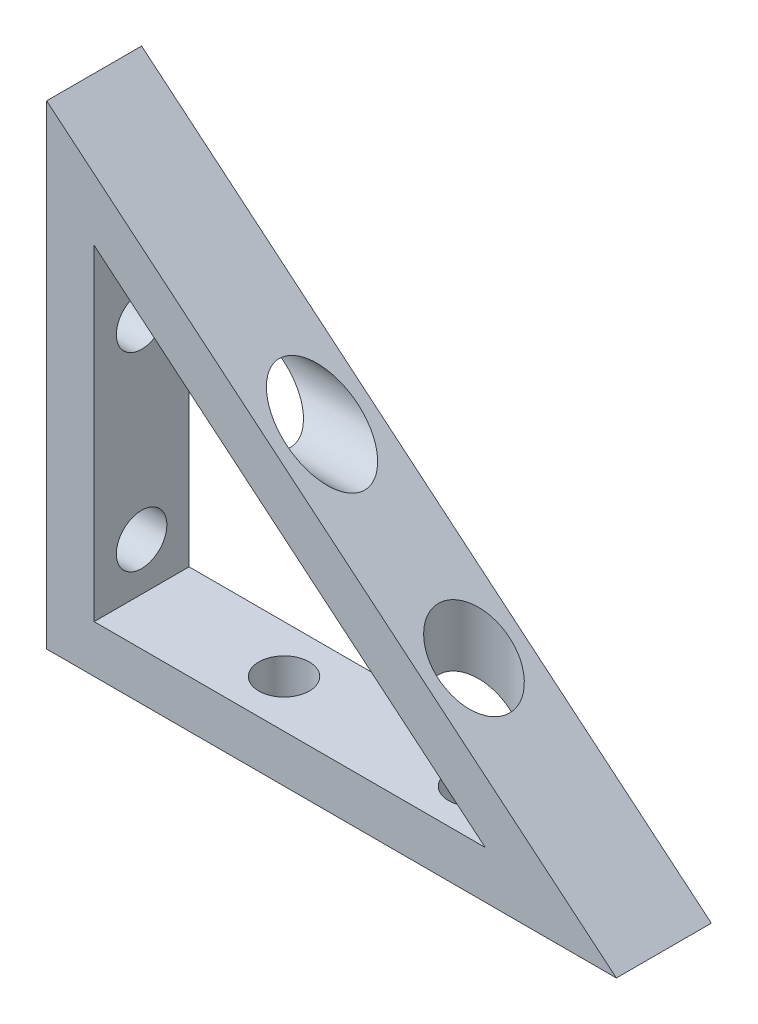
ISO-10303-21;
HEADER;
FILE_DESCRIPTION(('STEP AP214'),'2;1');
FILE_NAME('part.step','',(''),(''),'','','');
FILE_SCHEMA(('AUTOMOTIVE_DESIGN { 1 0 10303 214 1 1 1 1 }'));
ENDSEC;
DATA;
#1=APPLICATION_CONTEXT('core data for automotive mechanical design processes');
#2=APPLICATION_PROTOCOL_DEFINITION('international standard','automotive_design',2000,#1);
#3=PRODUCT_CONTEXT('',#1,'mechanical');
#4=PRODUCT('Part','Part','',(#3));
#5=PRODUCT_RELATED_PRODUCT_CATEGORY('part','',(#4));
#6=PRODUCT_DEFINITION_FORMATION('','',#4);
#7=PRODUCT_DEFINITION_CONTEXT('part definition',#1,'design');
#8=PRODUCT_DEFINITION('design','',#6,#7);
#9=PRODUCT_DEFINITION_SHAPE('','',#8);
#10=(LENGTH_UNIT() NAMED_UNIT(*) SI_UNIT(.MILLI.,.METRE.));
#11=(NAMED_UNIT(*) PLANE_ANGLE_UNIT() SI_UNIT($,.RADIAN.));
#12=(NAMED_UNIT(*) SI_UNIT($,.STERADIAN.) SOLID_ANGLE_UNIT());
#13=UNCERTAINTY_MEASURE_WITH_UNIT(LENGTH_MEASURE(1.E-05),#10,'distance_accuracy_value','');
#14=(GEOMETRIC_REPRESENTATION_CONTEXT(3) GLOBAL_UNCERTAINTY_ASSIGNED_CONTEXT((#13)) GLOBAL_UNIT_ASSIGNED_CONTEXT((#10,
#11,#12)) REPRESENTATION_CONTEXT('',''));
#15=CARTESIAN_POINT('',(0.,0.,0.));
#16=DIRECTION('',(0.,0.,1.));
#17=DIRECTION('',(1.,0.,0.));
#18=AXIS2_PLACEMENT_3D('',#15,#16,#17);
#19=CARTESIAN_POINT('',(0.,63.5,12.7));
#20=DIRECTION('',(-0.64018439966448,-0.768221279597376,0.));
#21=DIRECTION('',(0.768221279597376,-0.64018439966448,0.));
#22=AXIS2_PLACEMENT_3D('',#19,#20,#21);
#23=PLANE('',#22);
#24=CARTESIAN_POINT('',(30.48,38.1,6.35));
#25=DIRECTION('',(-0.64018439966448,-0.768221279597376,0.));
#26=DIRECTION('',(-0.768221279597376,0.64018439966448,0.));
#27=AXIS2_PLACEMENT_3D('',#24,#25,#26);
#28=ELLIPSE('',#27,7.43926281630109,4.7625);
#29=CARTESIAN_POINT('',(24.765,42.8625,6.35));
#30=VERTEX_POINT('',#29);
#31=EDGE_CURVE('E162',#30,#30,#28,.F.);
#32=ORIENTED_EDGE('',*,*,#31,.F.);
#33=EDGE_LOOP('',(#32));
#34=FACE_BOUND('',#33,.T.);
#35=DIRECTION('',(-0.768221279597376,0.64018439966448,0.));
#36=VECTOR('',#35,1.);
#37=CARTESIAN_POINT('',(0.,63.5,0.));
#38=LINE('',#37,#36);
#39=CARTESIAN_POINT('',(76.2,0.,0.));
#40=VERTEX_POINT('',#39);
#41=CARTESIAN_POINT('',(0.,63.5,0.));
#42=VERTEX_POINT('',#41);
#43=EDGE_CURVE('E131',#40,#42,#38,.T.);
#44=ORIENTED_EDGE('',*,*,#43,.T.);
#45=DIRECTION('',(0.,0.,-1.));
#46=VECTOR('',#45,1.);
#47=CARTESIAN_POINT('',(0.,63.5,12.7));
#48=LINE('',#47,#46);
#49=CARTESIAN_POINT('',(0.,63.5,12.7));
#50=VERTEX_POINT('',#49);
#51=EDGE_CURVE('E43',#50,#42,#48,.T.);
#52=ORIENTED_EDGE('',*,*,#51,.F.);
#53=DIRECTION('',(-0.768221279597376,0.64018439966448,0.));
#54=VECTOR('',#53,1.);
#55=CARTESIAN_POINT('',(0.,63.5,12.7));
#56=LINE('',#55,#54);
#57=CARTESIAN_POINT('',(76.2,0.,12.7));
#58=VERTEX_POINT('',#57);
#59=EDGE_CURVE('E123',#58,#50,#56,.T.);
#60=ORIENTED_EDGE('',*,*,#59,.F.);
#61=DIRECTION('',(0.,0.,-1.));
#62=VECTOR('',#61,1.);
#63=CARTESIAN_POINT('',(76.2,0.,12.7));
#64=LINE('',#63,#62);
#65=EDGE_CURVE('E11',#58,#40,#64,.T.);
#66=ORIENTED_EDGE('',*,*,#65,.T.);
#67=EDGE_LOOP('',(#44,#52,#60,#66));
#68=FACE_BOUND('',#67,.T.);
#69=CARTESIAN_POINT('',(50.8,21.1666666666667,6.35));
#70=DIRECTION('',(-0.64018439966448,-0.768221279597376,0.));
#71=DIRECTION('',(0.768221279597376,-0.64018439966448,0.));
#72=AXIS2_PLACEMENT_3D('',#69,#70,#71);
#73=ELLIPSE('',#72,6.19938568025091,4.7625);
#74=CARTESIAN_POINT('',(55.5625,17.1979166666667,6.35));
#75=VERTEX_POINT('',#74);
#76=EDGE_CURVE('E156',#75,#75,#73,.F.);
#77=ORIENTED_EDGE('',*,*,#76,.F.);
#78=EDGE_LOOP('',(#77));
#79=FACE_BOUND('',#78,.T.);
#80=ADVANCED_FACE('F35',(#34,#68,#79),#23,.F.);
#81=CARTESIAN_POINT('',(58.6609829115986,6.34999999999999,12.7));
#82=DIRECTION('',(-0.64018439966448,-0.768221279597376,0.));
#83=DIRECTION('',(0.768221279597376,-0.64018439966448,0.));
#84=AXIS2_PLACEMENT_3D('',#81,#82,#83);
#85=PLANE('',#84);
#86=CARTESIAN_POINT('',(20.5609829115986,38.1,6.35));
#87=DIRECTION('',(-0.64018439966448,-0.768221279597376,0.));
#88=DIRECTION('',(-0.768221279597376,0.64018439966448,0.));
#89=AXIS2_PLACEMENT_3D('',#86,#87,#88);
#90=ELLIPSE('',#89,7.43926281630109,4.7625);
#91=CARTESIAN_POINT('',(14.8459829115986,42.8625,6.35));
#92=VERTEX_POINT('',#91);
#93=EDGE_CURVE('E158',#92,#92,#90,.F.);
#94=ORIENTED_EDGE('',*,*,#93,.T.);
#95=EDGE_LOOP('',(#94));
#96=FACE_BOUND('',#95,.T.);
#97=DIRECTION('',(-0.768221279597376,0.64018439966448,0.));
#98=VECTOR('',#97,1.);
#99=CARTESIAN_POINT('',(58.6609829115986,6.34999999999999,0.));
#100=LINE('',#99,#98);
#101=CARTESIAN_POINT('',(58.6609829115986,6.34999999999999,0.));
#102=VERTEX_POINT('',#101);
#103=CARTESIAN_POINT('',(6.35,49.9424857596655,0.));
#104=VERTEX_POINT('',#103);
#105=EDGE_CURVE('E58',#102,#104,#100,.T.);
#106=ORIENTED_EDGE('',*,*,#105,.F.);
#107=DIRECTION('',(0.,0.,-1.));
#108=VECTOR('',#107,1.);
#109=CARTESIAN_POINT('',(58.6609829115986,6.34999999999999,12.7));
#110=LINE('',#109,#108);
#111=CARTESIAN_POINT('',(58.6609829115986,6.34999999999999,12.7));
#112=VERTEX_POINT('',#111);
#113=EDGE_CURVE('E93',#112,#102,#110,.T.);
#114=ORIENTED_EDGE('',*,*,#113,.F.);
#115=DIRECTION('',(-0.768221279597376,0.64018439966448,0.));
#116=VECTOR('',#115,1.);
#117=CARTESIAN_POINT('',(58.6609829115986,6.34999999999999,12.7));
#118=LINE('',#117,#116);
#119=CARTESIAN_POINT('',(6.35,49.9424857596655,12.7));
#120=VERTEX_POINT('',#119);
#121=EDGE_CURVE('E88',#112,#120,#118,.T.);
#122=ORIENTED_EDGE('',*,*,#121,.T.);
#123=DIRECTION('',(0.,0.,-1.));
#124=VECTOR('',#123,1.);
#125=CARTESIAN_POINT('',(6.35,49.9424857596655,12.7));
#126=LINE('',#125,#124);
#127=EDGE_CURVE('E92',#120,#104,#126,.T.);
#128=ORIENTED_EDGE('',*,*,#127,.T.);
#129=EDGE_LOOP('',(#106,#114,#122,#128));
#130=FACE_BOUND('',#129,.T.);
#131=CARTESIAN_POINT('',(50.8,12.9008190929988,6.35));
#132=DIRECTION('',(-0.64018439966448,-0.768221279597376,0.));
#133=DIRECTION('',(0.768221279597376,-0.64018439966448,0.));
#134=AXIS2_PLACEMENT_3D('',#131,#132,#133);
#135=ELLIPSE('',#134,6.19938568025091,4.7625);
#136=CARTESIAN_POINT('',(55.5625,8.93206909299878,6.35));
#137=VERTEX_POINT('',#136);
#138=EDGE_CURVE('E159',#137,#137,#135,.F.);
#139=ORIENTED_EDGE('',*,*,#138,.T.);
#140=EDGE_LOOP('',(#139));
#141=FACE_BOUND('',#140,.T.);
#142=ADVANCED_FACE('F90',(#96,#130,#141),#85,.T.);
#143=CARTESIAN_POINT('',(0.,0.,12.7));
#144=DIRECTION('',(0.,0.,-1.));
#145=DIRECTION('',(-1.,0.,0.));
#146=AXIS2_PLACEMENT_3D('',#143,#144,#145);
#147=PLANE('',#146);
#148=DIRECTION('',(1.,0.,0.));
#149=VECTOR('',#148,1.);
#150=CARTESIAN_POINT('',(76.2,0.,12.7));
#151=LINE('',#150,#149);
#152=CARTESIAN_POINT('',(0.,0.,12.7));
#153=VERTEX_POINT('',#152);
#154=EDGE_CURVE('E120',#153,#58,#151,.T.);
#155=ORIENTED_EDGE('',*,*,#154,.T.);
#156=ORIENTED_EDGE('',*,*,#59,.T.);
#157=DIRECTION('',(0.,-1.,0.));
#158=VECTOR('',#157,1.);
#159=CARTESIAN_POINT('',(0.,0.,12.7));
#160=LINE('',#159,#158);
#161=EDGE_CURVE('E126',#50,#153,#160,.T.);
#162=ORIENTED_EDGE('',*,*,#161,.T.);
#163=EDGE_LOOP('',(#155,#156,#162));
#164=FACE_BOUND('',#163,.T.);
#165=ORIENTED_EDGE('',*,*,#121,.F.);
#166=DIRECTION('',(1.,0.,0.));
#167=VECTOR('',#166,1.);
#168=CARTESIAN_POINT('',(6.35,6.35,12.7));
#169=LINE('',#168,#167);
#170=CARTESIAN_POINT('',(6.35,6.35,12.7));
#171=VERTEX_POINT('',#170);
#172=EDGE_CURVE('E108',#171,#112,#169,.T.);
#173=ORIENTED_EDGE('',*,*,#172,.F.);
#174=DIRECTION('',(0.,-1.,0.));
#175=VECTOR('',#174,1.);
#176=CARTESIAN_POINT('',(6.35,49.9424857596655,12.7));
#177=LINE('',#176,#175);
#178=EDGE_CURVE('E97',#120,#171,#177,.T.);
#179=ORIENTED_EDGE('',*,*,#178,.F.);
#180=EDGE_LOOP('',(#165,#173,#179));
#181=FACE_BOUND('',#180,.T.);
#182=ADVANCED_FACE('F107',(#164,#181),#147,.F.);
#183=CARTESIAN_POINT('',(0.,0.,0.));
#184=DIRECTION('',(0.,0.,-1.));
#185=DIRECTION('',(-1.,0.,0.));
#186=AXIS2_PLACEMENT_3D('',#183,#184,#185);
#187=PLANE('',#186);
#188=DIRECTION('',(1.,0.,0.));
#189=VECTOR('',#188,1.);
#190=CARTESIAN_POINT('',(76.2,0.,0.));
#191=LINE('',#190,#189);
#192=CARTESIAN_POINT('',(0.,0.,0.));
#193=VERTEX_POINT('',#192);
#194=EDGE_CURVE('E105',#193,#40,#191,.T.);
#195=ORIENTED_EDGE('',*,*,#194,.F.);
#196=DIRECTION('',(0.,-1.,0.));
#197=VECTOR('',#196,1.);
#198=CARTESIAN_POINT('',(0.,0.,0.));
#199=LINE('',#198,#197);
#200=EDGE_CURVE('E124',#42,#193,#199,.T.);
#201=ORIENTED_EDGE('',*,*,#200,.F.);
#202=ORIENTED_EDGE('',*,*,#43,.F.);
#203=EDGE_LOOP('',(#195,#201,#202));
#204=FACE_BOUND('',#203,.T.);
#205=DIRECTION('',(1.,0.,0.));
#206=VECTOR('',#205,1.);
#207=CARTESIAN_POINT('',(6.35,6.35,0.));
#208=LINE('',#207,#206);
#209=CARTESIAN_POINT('',(6.35,6.35,0.));
#210=VERTEX_POINT('',#209);
#211=EDGE_CURVE('E98',#210,#102,#208,.T.);
#212=ORIENTED_EDGE('',*,*,#211,.T.);
#213=ORIENTED_EDGE('',*,*,#105,.T.);
#214=DIRECTION('',(0.,-1.,0.));
#215=VECTOR('',#214,1.);
#216=CARTESIAN_POINT('',(6.35,49.9424857596655,0.));
#217=LINE('',#216,#215);
#218=EDGE_CURVE('E104',#104,#210,#217,.T.);
#219=ORIENTED_EDGE('',*,*,#218,.T.);
#220=EDGE_LOOP('',(#212,#213,#219));
#221=FACE_BOUND('',#220,.T.);
#222=ADVANCED_FACE('F145',(#204,#221),#187,.T.);
#223=CARTESIAN_POINT('',(76.2,0.,12.7));
#224=DIRECTION('',(0.,1.,0.));
#225=DIRECTION('',(-1.,0.,0.));
#226=AXIS2_PLACEMENT_3D('',#223,#224,#225);
#227=PLANE('',#226);
#228=CARTESIAN_POINT('',(25.4,0.,6.35));
#229=DIRECTION('',(0.,1.,0.));
#230=DIRECTION('',(0.,0.,1.));
#231=AXIS2_PLACEMENT_3D('',#228,#229,#230);
#232=CIRCLE('',#231,3.3782);
#233=CARTESIAN_POINT('',(25.4,0.,9.7282));
#234=VERTEX_POINT('',#233);
#235=EDGE_CURVE('E172',#234,#234,#232,.T.);
#236=ORIENTED_EDGE('',*,*,#235,.T.);
#237=EDGE_LOOP('',(#236));
#238=FACE_BOUND('',#237,.T.);
#239=CARTESIAN_POINT('',(50.8,0.,6.35));
#240=DIRECTION('',(0.,1.,0.));
#241=DIRECTION('',(0.,0.,1.));
#242=AXIS2_PLACEMENT_3D('',#239,#240,#241);
#243=CIRCLE('',#242,3.3782);
#244=CARTESIAN_POINT('',(50.8,0.,9.7282));
#245=VERTEX_POINT('',#244);
#246=EDGE_CURVE('E178',#245,#245,#243,.T.);
#247=ORIENTED_EDGE('',*,*,#246,.T.);
#248=EDGE_LOOP('',(#247));
#249=FACE_BOUND('',#248,.T.);
#250=ORIENTED_EDGE('',*,*,#194,.T.);
#251=ORIENTED_EDGE('',*,*,#65,.F.);
#252=ORIENTED_EDGE('',*,*,#154,.F.);
#253=DIRECTION('',(0.,0.,-1.));
#254=VECTOR('',#253,1.);
#255=CARTESIAN_POINT('',(0.,0.,12.7));
#256=LINE('',#255,#254);
#257=EDGE_CURVE('E128',#153,#193,#256,.T.);
#258=ORIENTED_EDGE('',*,*,#257,.T.);
#259=EDGE_LOOP('',(#250,#251,#252,#258));
#260=FACE_BOUND('',#259,.T.);
#261=ADVANCED_FACE('F37',(#238,#249,#260),#227,.F.);
#262=CARTESIAN_POINT('',(0.,0.,12.7));
#263=DIRECTION('',(1.,0.,0.));
#264=DIRECTION('',(0.,0.,-1.));
#265=AXIS2_PLACEMENT_3D('',#262,#263,#264);
#266=PLANE('',#265);
#267=CARTESIAN_POINT('',(0.,12.7,6.35));
#268=DIRECTION('',(1.,0.,0.));
#269=DIRECTION('',(0.,0.,-1.));
#270=AXIS2_PLACEMENT_3D('',#267,#268,#269);
#271=CIRCLE('',#270,3.3782);
#272=CARTESIAN_POINT('',(0.,12.7,2.9718));
#273=VERTEX_POINT('',#272);
#274=EDGE_CURVE('E184',#273,#273,#271,.T.);
#275=ORIENTED_EDGE('',*,*,#274,.T.);
#276=EDGE_LOOP('',(#275));
#277=FACE_BOUND('',#276,.T.);
#278=CARTESIAN_POINT('',(0.,38.1,6.35));
#279=DIRECTION('',(1.,0.,0.));
#280=DIRECTION('',(0.,0.,-1.));
#281=AXIS2_PLACEMENT_3D('',#278,#279,#280);
#282=CIRCLE('',#281,3.3782);
#283=CARTESIAN_POINT('',(0.,38.1,2.9718));
#284=VERTEX_POINT('',#283);
#285=EDGE_CURVE('E114',#284,#284,#282,.T.);
#286=ORIENTED_EDGE('',*,*,#285,.T.);
#287=EDGE_LOOP('',(#286));
#288=FACE_BOUND('',#287,.T.);
#289=ORIENTED_EDGE('',*,*,#200,.T.);
#290=ORIENTED_EDGE('',*,*,#257,.F.);
#291=ORIENTED_EDGE('',*,*,#161,.F.);
#292=ORIENTED_EDGE('',*,*,#51,.T.);
#293=EDGE_LOOP('',(#289,#290,#291,#292));
#294=FACE_BOUND('',#293,.T.);
#295=ADVANCED_FACE('F140',(#277,#288,#294),#266,.F.);
#296=CARTESIAN_POINT('',(6.35,49.9424857596655,12.7));
#297=DIRECTION('',(1.,0.,0.));
#298=DIRECTION('',(0.,1.,0.));
#299=AXIS2_PLACEMENT_3D('',#296,#297,#298);
#300=PLANE('',#299);
#301=CARTESIAN_POINT('',(6.35,38.1,6.35));
#302=DIRECTION('',(1.,0.,0.));
#303=DIRECTION('',(0.,0.,-1.));
#304=AXIS2_PLACEMENT_3D('',#301,#302,#303);
#305=CIRCLE('',#304,3.37819999999998);
#306=CARTESIAN_POINT('',(6.35,38.1,2.97180000000002));
#307=VERTEX_POINT('',#306);
#308=EDGE_CURVE('E187',#307,#307,#305,.T.);
#309=ORIENTED_EDGE('',*,*,#308,.F.);
#310=EDGE_LOOP('',(#309));
#311=FACE_BOUND('',#310,.T.);
#312=ORIENTED_EDGE('',*,*,#218,.F.);
#313=ORIENTED_EDGE('',*,*,#127,.F.);
#314=ORIENTED_EDGE('',*,*,#178,.T.);
#315=DIRECTION('',(0.,0.,-1.));
#316=VECTOR('',#315,1.);
#317=CARTESIAN_POINT('',(6.35,6.35,12.7));
#318=LINE('',#317,#316);
#319=EDGE_CURVE('E50',#171,#210,#318,.T.);
#320=ORIENTED_EDGE('',*,*,#319,.T.);
#321=EDGE_LOOP('',(#312,#313,#314,#320));
#322=FACE_BOUND('',#321,.T.);
#323=CARTESIAN_POINT('',(6.35,12.7,6.35));
#324=DIRECTION('',(1.,0.,0.));
#325=DIRECTION('',(0.,0.,-1.));
#326=AXIS2_PLACEMENT_3D('',#323,#324,#325);
#327=CIRCLE('',#326,3.37819999999999);
#328=CARTESIAN_POINT('',(6.35,12.7,2.97180000000001));
#329=VERTEX_POINT('',#328);
#330=EDGE_CURVE('E181',#329,#329,#327,.T.);
#331=ORIENTED_EDGE('',*,*,#330,.F.);
#332=EDGE_LOOP('',(#331));
#333=FACE_BOUND('',#332,.T.);
#334=ADVANCED_FACE('F101',(#311,#322,#333),#300,.T.);
#335=CARTESIAN_POINT('',(6.35,6.35,12.7));
#336=DIRECTION('',(0.,1.,0.));
#337=DIRECTION('',(-1.,0.,0.));
#338=AXIS2_PLACEMENT_3D('',#335,#336,#337);
#339=PLANE('',#338);
#340=CARTESIAN_POINT('',(50.8,6.35,6.35));
#341=DIRECTION('',(0.,1.,0.));
#342=DIRECTION('',(0.,0.,1.));
#343=AXIS2_PLACEMENT_3D('',#340,#341,#342);
#344=CIRCLE('',#343,3.37819999999998);
#345=CARTESIAN_POINT('',(50.8,6.35,9.72819999999998));
#346=VERTEX_POINT('',#345);
#347=EDGE_CURVE('E175',#346,#346,#344,.T.);
#348=ORIENTED_EDGE('',*,*,#347,.F.);
#349=EDGE_LOOP('',(#348));
#350=FACE_BOUND('',#349,.T.);
#351=ORIENTED_EDGE('',*,*,#211,.F.);
#352=ORIENTED_EDGE('',*,*,#319,.F.);
#353=ORIENTED_EDGE('',*,*,#172,.T.);
#354=ORIENTED_EDGE('',*,*,#113,.T.);
#355=EDGE_LOOP('',(#351,#352,#353,#354));
#356=FACE_BOUND('',#355,.T.);
#357=CARTESIAN_POINT('',(25.4,6.35,6.35));
#358=DIRECTION('',(0.,1.,0.));
#359=DIRECTION('',(0.,0.,1.));
#360=AXIS2_PLACEMENT_3D('',#357,#358,#359);
#361=CIRCLE('',#360,3.37819999999999);
#362=CARTESIAN_POINT('',(25.4,6.35,9.72819999999999));
#363=VERTEX_POINT('',#362);
#364=EDGE_CURVE('E169',#363,#363,#361,.T.);
#365=ORIENTED_EDGE('',*,*,#364,.F.);
#366=EDGE_LOOP('',(#365));
#367=FACE_BOUND('',#366,.T.);
#368=ADVANCED_FACE('F197',(#350,#356,#367),#339,.T.);
#369=CARTESIAN_POINT('',(6.35,38.1,6.35));
#370=DIRECTION('',(1.,0.,0.));
#371=DIRECTION('',(0.,0.,-1.));
#372=AXIS2_PLACEMENT_3D('',#369,#370,#371);
#373=CYLINDRICAL_SURFACE('',#372,3.37819999999999);
#374=ORIENTED_EDGE('',*,*,#285,.F.);
#375=EDGE_LOOP('',(#374));
#376=FACE_BOUND('',#375,.T.);
#377=ORIENTED_EDGE('',*,*,#308,.T.);
#378=EDGE_LOOP('',(#377));
#379=FACE_BOUND('',#378,.T.);
#380=ADVANCED_FACE('F193',(#376,#379),#373,.F.);
#381=CARTESIAN_POINT('',(6.35,12.7,6.35));
#382=DIRECTION('',(1.,0.,0.));
#383=DIRECTION('',(0.,0.,-1.));
#384=AXIS2_PLACEMENT_3D('',#381,#382,#383);
#385=CYLINDRICAL_SURFACE('',#384,3.37819999999999);
#386=ORIENTED_EDGE('',*,*,#274,.F.);
#387=EDGE_LOOP('',(#386));
#388=FACE_BOUND('',#387,.T.);
#389=ORIENTED_EDGE('',*,*,#330,.T.);
#390=EDGE_LOOP('',(#389));
#391=FACE_BOUND('',#390,.T.);
#392=ADVANCED_FACE('F196',(#388,#391),#385,.F.);
#393=CARTESIAN_POINT('',(50.8,6.34999999999999,6.35));
#394=DIRECTION('',(0.,1.,0.));
#395=DIRECTION('',(0.,0.,1.));
#396=AXIS2_PLACEMENT_3D('',#393,#394,#395);
#397=CYLINDRICAL_SURFACE('',#396,3.37819999999999);
#398=ORIENTED_EDGE('',*,*,#246,.F.);
#399=EDGE_LOOP('',(#398));
#400=FACE_BOUND('',#399,.T.);
#401=ORIENTED_EDGE('',*,*,#347,.T.);
#402=EDGE_LOOP('',(#401));
#403=FACE_BOUND('',#402,.T.);
#404=ADVANCED_FACE('F228',(#400,#403),#397,.F.);
#405=CARTESIAN_POINT('',(25.4,6.35,6.35));
#406=DIRECTION('',(0.,1.,0.));
#407=DIRECTION('',(0.,0.,1.));
#408=AXIS2_PLACEMENT_3D('',#405,#406,#407);
#409=CYLINDRICAL_SURFACE('',#408,3.37819999999999);
#410=ORIENTED_EDGE('',*,*,#235,.F.);
#411=EDGE_LOOP('',(#410));
#412=FACE_BOUND('',#411,.T.);
#413=ORIENTED_EDGE('',*,*,#364,.T.);
#414=EDGE_LOOP('',(#413));
#415=FACE_BOUND('',#414,.T.);
#416=ADVANCED_FACE('F231',(#412,#415),#409,.F.);
#417=CARTESIAN_POINT('',(76.2,38.1,6.35));
#418=DIRECTION('',(-1.,0.,0.));
#419=DIRECTION('',(0.,-1.,0.));
#420=AXIS2_PLACEMENT_3D('',#417,#418,#419);
#421=CYLINDRICAL_SURFACE('',#420,4.7625);
#422=ORIENTED_EDGE('',*,*,#93,.F.);
#423=EDGE_LOOP('',(#422));
#424=FACE_BOUND('',#423,.T.);
#425=ORIENTED_EDGE('',*,*,#31,.T.);
#426=EDGE_LOOP('',(#425));
#427=FACE_BOUND('',#426,.T.);
#428=ADVANCED_FACE('F238',(#424,#427),#421,.F.);
#429=CARTESIAN_POINT('',(50.8,63.5,6.35));
#430=DIRECTION('',(0.,-1.,0.));
#431=DIRECTION('',(1.,0.,0.));
#432=AXIS2_PLACEMENT_3D('',#429,#430,#431);
#433=CYLINDRICAL_SURFACE('',#432,4.7625);
#434=ORIENTED_EDGE('',*,*,#138,.F.);
#435=EDGE_LOOP('',(#434));
#436=FACE_BOUND('',#435,.T.);
#437=ORIENTED_EDGE('',*,*,#76,.T.);
#438=EDGE_LOOP('',(#437));
#439=FACE_BOUND('',#438,.T.);
#440=ADVANCED_FACE('F244',(#436,#439),#433,.F.);
#441=CLOSED_SHELL('',(#80,#142,#182,#222,#261,#295,#334,#368,#380,#392,#404,#416,#428,#440));
#442=MANIFOLD_SOLID_BREP('B2',#441);
#443=ADVANCED_BREP_SHAPE_REPRESENTATION('',(#18,#442),#14);
#444=SHAPE_DEFINITION_REPRESENTATION(#9,#443);
ENDSEC;
END-ISO-10303-21;
